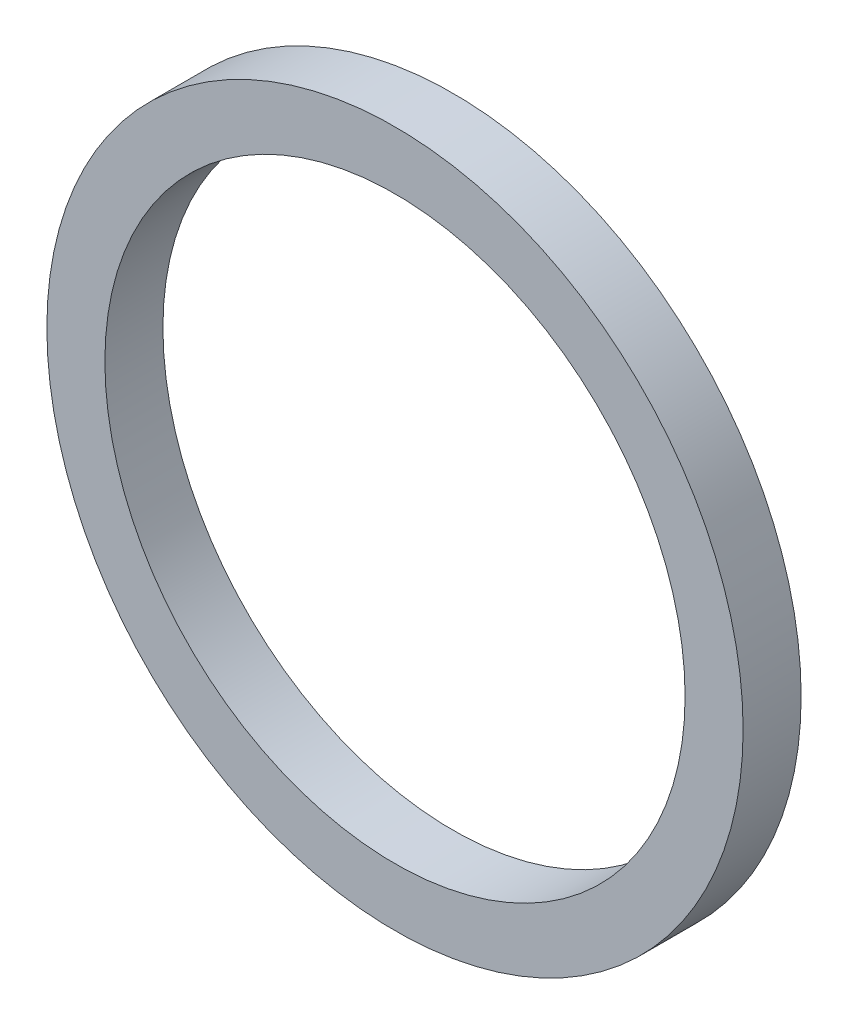
ISO-10303-21;
HEADER;
FILE_DESCRIPTION(('STEP AP214'),'2;1');
FILE_NAME('part.step','',(''),(''),'','','');
FILE_SCHEMA(('AUTOMOTIVE_DESIGN { 1 0 10303 214 1 1 1 1 }'));
ENDSEC;
DATA;
#1=APPLICATION_CONTEXT('core data for automotive mechanical design processes');
#2=APPLICATION_PROTOCOL_DEFINITION('international standard','automotive_design',2000,#1);
#3=PRODUCT_CONTEXT('',#1,'mechanical');
#4=PRODUCT('Part','Part','',(#3));
#5=PRODUCT_RELATED_PRODUCT_CATEGORY('part','',(#4));
#6=PRODUCT_DEFINITION_FORMATION('','',#4);
#7=PRODUCT_DEFINITION_CONTEXT('part definition',#1,'design');
#8=PRODUCT_DEFINITION('design','',#6,#7);
#9=PRODUCT_DEFINITION_SHAPE('','',#8);
#10=(LENGTH_UNIT() NAMED_UNIT(*) SI_UNIT(.MILLI.,.METRE.));
#11=(NAMED_UNIT(*) PLANE_ANGLE_UNIT() SI_UNIT($,.RADIAN.));
#12=(NAMED_UNIT(*) SI_UNIT($,.STERADIAN.) SOLID_ANGLE_UNIT());
#13=UNCERTAINTY_MEASURE_WITH_UNIT(LENGTH_MEASURE(1.E-05),#10,'distance_accuracy_value','');
#14=(GEOMETRIC_REPRESENTATION_CONTEXT(3) GLOBAL_UNCERTAINTY_ASSIGNED_CONTEXT((#13)) GLOBAL_UNIT_ASSIGNED_CONTEXT((#10,
#11,#12)) REPRESENTATION_CONTEXT('',''));
#15=CARTESIAN_POINT('',(0.,0.,0.));
#16=DIRECTION('',(0.,0.,1.));
#17=DIRECTION('',(1.,0.,0.));
#18=AXIS2_PLACEMENT_3D('',#15,#16,#17);
#19=CARTESIAN_POINT('',(0.,0.,2.54));
#20=DIRECTION('',(0.,0.,-1.));
#21=DIRECTION('',(-1.,0.,0.));
#22=AXIS2_PLACEMENT_3D('',#19,#20,#21);
#23=CYLINDRICAL_SURFACE('',#22,15.24);
#24=CARTESIAN_POINT('',(0.,0.,2.54));
#25=DIRECTION('',(0.,0.,1.));
#26=DIRECTION('',(1.,0.,0.));
#27=AXIS2_PLACEMENT_3D('',#24,#25,#26);
#28=CIRCLE('',#27,15.24);
#29=CARTESIAN_POINT('',(15.24,0.,2.54));
#30=VERTEX_POINT('',#29);
#31=EDGE_CURVE('E10',#30,#30,#28,.T.);
#32=ORIENTED_EDGE('',*,*,#31,.F.);
#33=EDGE_LOOP('',(#32));
#34=FACE_BOUND('',#33,.T.);
#35=CARTESIAN_POINT('',(0.,0.,0.));
#36=DIRECTION('',(0.,0.,1.));
#37=DIRECTION('',(1.,0.,0.));
#38=AXIS2_PLACEMENT_3D('',#35,#36,#37);
#39=CIRCLE('',#38,15.24);
#40=CARTESIAN_POINT('',(15.24,0.,0.));
#41=VERTEX_POINT('',#40);
#42=EDGE_CURVE('E36',#41,#41,#39,.T.);
#43=ORIENTED_EDGE('',*,*,#42,.T.);
#44=EDGE_LOOP('',(#43));
#45=FACE_BOUND('',#44,.T.);
#46=ADVANCED_FACE('F33',(#34,#45),#23,.T.);
#47=CARTESIAN_POINT('',(0.,0.,2.54));
#48=DIRECTION('',(0.,0.,1.));
#49=DIRECTION('',(1.,0.,0.));
#50=AXIS2_PLACEMENT_3D('',#47,#48,#49);
#51=PLANE('',#50);
#52=CARTESIAN_POINT('',(0.,0.,2.54));
#53=DIRECTION('',(0.,0.,1.));
#54=DIRECTION('',(1.,0.,0.));
#55=AXIS2_PLACEMENT_3D('',#52,#53,#54);
#56=CIRCLE('',#55,12.7);
#57=CARTESIAN_POINT('',(12.7,0.,2.54));
#58=VERTEX_POINT('',#57);
#59=EDGE_CURVE('E45',#58,#58,#56,.T.);
#60=ORIENTED_EDGE('',*,*,#59,.F.);
#61=EDGE_LOOP('',(#60));
#62=FACE_BOUND('',#61,.T.);
#63=ORIENTED_EDGE('',*,*,#31,.T.);
#64=EDGE_LOOP('',(#63));
#65=FACE_BOUND('',#64,.T.);
#66=ADVANCED_FACE('F60',(#62,#65),#51,.T.);
#67=CARTESIAN_POINT('',(0.,0.,0.));
#68=DIRECTION('',(0.,0.,1.));
#69=DIRECTION('',(1.,0.,0.));
#70=AXIS2_PLACEMENT_3D('',#67,#68,#69);
#71=PLANE('',#70);
#72=CARTESIAN_POINT('',(0.,0.,0.));
#73=DIRECTION('',(0.,0.,1.));
#74=DIRECTION('',(1.,0.,0.));
#75=AXIS2_PLACEMENT_3D('',#72,#73,#74);
#76=CIRCLE('',#75,12.7);
#77=CARTESIAN_POINT('',(12.7,0.,0.));
#78=VERTEX_POINT('',#77);
#79=EDGE_CURVE('E43',#78,#78,#76,.T.);
#80=ORIENTED_EDGE('',*,*,#79,.T.);
#81=EDGE_LOOP('',(#80));
#82=FACE_BOUND('',#81,.T.);
#83=ORIENTED_EDGE('',*,*,#42,.F.);
#84=EDGE_LOOP('',(#83));
#85=FACE_BOUND('',#84,.T.);
#86=ADVANCED_FACE('F51',(#82,#85),#71,.F.);
#87=CARTESIAN_POINT('',(0.,0.,0.));
#88=DIRECTION('',(0.,0.,1.));
#89=DIRECTION('',(1.,0.,0.));
#90=AXIS2_PLACEMENT_3D('',#87,#88,#89);
#91=CYLINDRICAL_SURFACE('',#90,12.7);
#92=ORIENTED_EDGE('',*,*,#79,.F.);
#93=EDGE_LOOP('',(#92));
#94=FACE_BOUND('',#93,.T.);
#95=ORIENTED_EDGE('',*,*,#59,.T.);
#96=EDGE_LOOP('',(#95));
#97=FACE_BOUND('',#96,.T.);
#98=ADVANCED_FACE('F54',(#94,#97),#91,.F.);
#99=CLOSED_SHELL('',(#46,#66,#86,#98));
#100=MANIFOLD_SOLID_BREP('B2',#99);
#101=ADVANCED_BREP_SHAPE_REPRESENTATION('',(#18,#100),#14);
#102=SHAPE_DEFINITION_REPRESENTATION(#9,#101);
ENDSEC;
END-ISO-10303-21;
